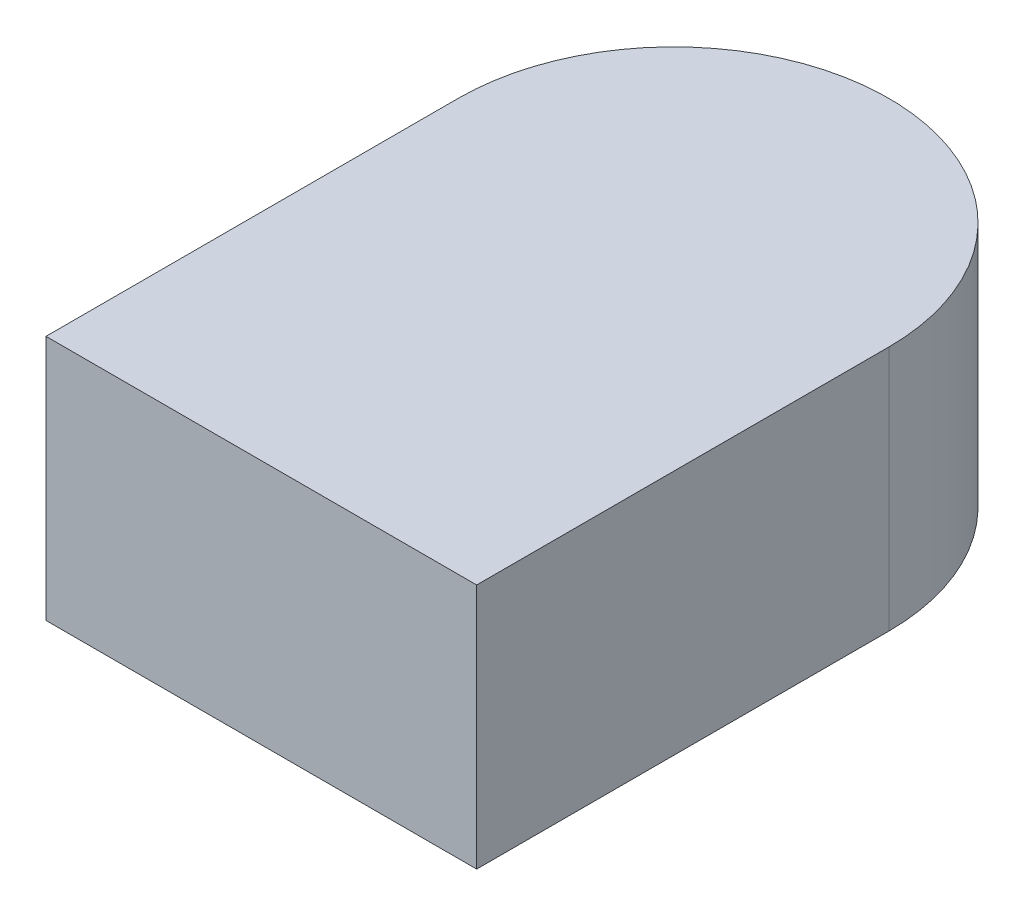
ISO-10303-21;
HEADER;
FILE_DESCRIPTION(('STEP AP214'),'2;1');
FILE_NAME('part.step','',(''),(''),'','','');
FILE_SCHEMA(('AUTOMOTIVE_DESIGN { 1 0 10303 214 1 1 1 1 }'));
ENDSEC;
DATA;
#1=APPLICATION_CONTEXT('core data for automotive mechanical design processes');
#2=APPLICATION_PROTOCOL_DEFINITION('international standard','automotive_design',2000,#1);
#3=PRODUCT_CONTEXT('',#1,'mechanical');
#4=PRODUCT('Part','Part','',(#3));
#5=PRODUCT_RELATED_PRODUCT_CATEGORY('part','',(#4));
#6=PRODUCT_DEFINITION_FORMATION('','',#4);
#7=PRODUCT_DEFINITION_CONTEXT('part definition',#1,'design');
#8=PRODUCT_DEFINITION('design','',#6,#7);
#9=PRODUCT_DEFINITION_SHAPE('','',#8);
#10=(LENGTH_UNIT() NAMED_UNIT(*) SI_UNIT(.MILLI.,.METRE.));
#11=(NAMED_UNIT(*) PLANE_ANGLE_UNIT() SI_UNIT($,.RADIAN.));
#12=(NAMED_UNIT(*) SI_UNIT($,.STERADIAN.) SOLID_ANGLE_UNIT());
#13=UNCERTAINTY_MEASURE_WITH_UNIT(LENGTH_MEASURE(1.E-05),#10,'distance_accuracy_value','');
#14=(GEOMETRIC_REPRESENTATION_CONTEXT(3) GLOBAL_UNCERTAINTY_ASSIGNED_CONTEXT((#13)) GLOBAL_UNIT_ASSIGNED_CONTEXT((#10,
#11,#12)) REPRESENTATION_CONTEXT('',''));
#15=CARTESIAN_POINT('',(0.,0.,0.));
#16=DIRECTION('',(0.,0.,1.));
#17=DIRECTION('',(1.,0.,0.));
#18=AXIS2_PLACEMENT_3D('',#15,#16,#17);
#19=CARTESIAN_POINT('',(0.175,0.2,-0.1675));
#20=DIRECTION('',(-1.,0.,0.));
#21=DIRECTION('',(0.,0.,1.));
#22=AXIS2_PLACEMENT_3D('',#19,#20,#21);
#23=PLANE('',#22);
#24=DIRECTION('',(0.,0.,-1.));
#25=VECTOR('',#24,1.);
#26=CARTESIAN_POINT('',(0.175,0.,-0.1675));
#27=LINE('',#26,#25);
#28=CARTESIAN_POINT('',(0.175,0.,0.1675));
#29=VERTEX_POINT('',#28);
#30=CARTESIAN_POINT('',(0.175,0.,-0.1675));
#31=VERTEX_POINT('',#30);
#32=EDGE_CURVE('E107',#29,#31,#27,.T.);
#33=ORIENTED_EDGE('',*,*,#32,.T.);
#34=DIRECTION('',(0.,-1.,0.));
#35=VECTOR('',#34,1.);
#36=CARTESIAN_POINT('',(0.175,0.2,-0.1675));
#37=LINE('',#36,#35);
#38=CARTESIAN_POINT('',(0.175,0.2,-0.1675));
#39=VERTEX_POINT('',#38);
#40=EDGE_CURVE('E11',#39,#31,#37,.T.);
#41=ORIENTED_EDGE('',*,*,#40,.F.);
#42=DIRECTION('',(0.,0.,-1.));
#43=VECTOR('',#42,1.);
#44=CARTESIAN_POINT('',(0.175,0.2,-0.1675));
#45=LINE('',#44,#43);
#46=CARTESIAN_POINT('',(0.175,0.2,0.1675));
#47=VERTEX_POINT('',#46);
#48=EDGE_CURVE('E91',#47,#39,#45,.T.);
#49=ORIENTED_EDGE('',*,*,#48,.F.);
#50=DIRECTION('',(0.,-1.,0.));
#51=VECTOR('',#50,1.);
#52=CARTESIAN_POINT('',(0.175,0.2,0.1675));
#53=LINE('',#52,#51);
#54=EDGE_CURVE('E103',#47,#29,#53,.T.);
#55=ORIENTED_EDGE('',*,*,#54,.T.);
#56=EDGE_LOOP('',(#33,#41,#49,#55));
#57=FACE_BOUND('',#56,.T.);
#58=ADVANCED_FACE('F39',(#57),#23,.F.);
#59=CARTESIAN_POINT('',(0.,0.2,-0.1675));
#60=DIRECTION('',(0.,-1.,0.));
#61=DIRECTION('',(0.,0.,-1.));
#62=AXIS2_PLACEMENT_3D('',#59,#60,#61);
#63=CYLINDRICAL_SURFACE('',#62,0.175);
#64=CARTESIAN_POINT('',(0.,0.,-0.1675));
#65=DIRECTION('',(0.,1.,0.));
#66=DIRECTION('',(0.,0.,1.));
#67=AXIS2_PLACEMENT_3D('',#64,#65,#66);
#68=CIRCLE('',#67,0.175);
#69=CARTESIAN_POINT('',(-0.175,0.,-0.1675));
#70=VERTEX_POINT('',#69);
#71=EDGE_CURVE('E96',#31,#70,#68,.T.);
#72=ORIENTED_EDGE('',*,*,#71,.T.);
#73=DIRECTION('',(0.,-1.,0.));
#74=VECTOR('',#73,1.);
#75=CARTESIAN_POINT('',(-0.175,0.2,-0.1675));
#76=LINE('',#75,#74);
#77=CARTESIAN_POINT('',(-0.175,0.2,-0.1675));
#78=VERTEX_POINT('',#77);
#79=EDGE_CURVE('E48',#78,#70,#76,.T.);
#80=ORIENTED_EDGE('',*,*,#79,.F.);
#81=CARTESIAN_POINT('',(0.,0.2,-0.1675));
#82=DIRECTION('',(0.,1.,0.));
#83=DIRECTION('',(0.,0.,1.));
#84=AXIS2_PLACEMENT_3D('',#81,#82,#83);
#85=CIRCLE('',#84,0.175);
#86=EDGE_CURVE('E86',#39,#78,#85,.T.);
#87=ORIENTED_EDGE('',*,*,#86,.F.);
#88=ORIENTED_EDGE('',*,*,#40,.T.);
#89=EDGE_LOOP('',(#72,#80,#87,#88));
#90=FACE_BOUND('',#89,.T.);
#91=ADVANCED_FACE('F95',(#90),#63,.T.);
#92=CARTESIAN_POINT('',(-0.175,0.2,-0.1675));
#93=DIRECTION('',(1.,0.,0.));
#94=DIRECTION('',(0.,0.,-1.));
#95=AXIS2_PLACEMENT_3D('',#92,#93,#94);
#96=PLANE('',#95);
#97=DIRECTION('',(0.,0.,1.));
#98=VECTOR('',#97,1.);
#99=CARTESIAN_POINT('',(-0.175,0.,-0.1675));
#100=LINE('',#99,#98);
#101=CARTESIAN_POINT('',(-0.175,0.,0.1675));
#102=VERTEX_POINT('',#101);
#103=EDGE_CURVE('E73',#70,#102,#100,.T.);
#104=ORIENTED_EDGE('',*,*,#103,.T.);
#105=DIRECTION('',(0.,-1.,0.));
#106=VECTOR('',#105,1.);
#107=CARTESIAN_POINT('',(-0.175,0.2,0.1675));
#108=LINE('',#107,#106);
#109=CARTESIAN_POINT('',(-0.175,0.2,0.1675));
#110=VERTEX_POINT('',#109);
#111=EDGE_CURVE('E98',#110,#102,#108,.T.);
#112=ORIENTED_EDGE('',*,*,#111,.F.);
#113=DIRECTION('',(0.,0.,1.));
#114=VECTOR('',#113,1.);
#115=CARTESIAN_POINT('',(-0.175,0.2,-0.1675));
#116=LINE('',#115,#114);
#117=EDGE_CURVE('E89',#78,#110,#116,.T.);
#118=ORIENTED_EDGE('',*,*,#117,.F.);
#119=ORIENTED_EDGE('',*,*,#79,.T.);
#120=EDGE_LOOP('',(#104,#112,#118,#119));
#121=FACE_BOUND('',#120,.T.);
#122=ADVANCED_FACE('F99',(#121),#96,.F.);
#123=CARTESIAN_POINT('',(-0.175,0.2,0.1675));
#124=DIRECTION('',(0.,0.,-1.));
#125=DIRECTION('',(-1.,0.,0.));
#126=AXIS2_PLACEMENT_3D('',#123,#124,#125);
#127=PLANE('',#126);
#128=DIRECTION('',(1.,0.,0.));
#129=VECTOR('',#128,1.);
#130=CARTESIAN_POINT('',(-0.175,0.,0.1675));
#131=LINE('',#130,#129);
#132=EDGE_CURVE('E79',#102,#29,#131,.T.);
#133=ORIENTED_EDGE('',*,*,#132,.T.);
#134=ORIENTED_EDGE('',*,*,#54,.F.);
#135=DIRECTION('',(1.,0.,0.));
#136=VECTOR('',#135,1.);
#137=CARTESIAN_POINT('',(-0.175,0.2,0.1675));
#138=LINE('',#137,#136);
#139=EDGE_CURVE('E56',#110,#47,#138,.T.);
#140=ORIENTED_EDGE('',*,*,#139,.F.);
#141=ORIENTED_EDGE('',*,*,#111,.T.);
#142=EDGE_LOOP('',(#133,#134,#140,#141));
#143=FACE_BOUND('',#142,.T.);
#144=ADVANCED_FACE('F120',(#143),#127,.F.);
#145=CARTESIAN_POINT('',(0.,0.2,-0.1675));
#146=DIRECTION('',(0.,1.,0.));
#147=DIRECTION('',(0.,0.,1.));
#148=AXIS2_PLACEMENT_3D('',#145,#146,#147);
#149=PLANE('',#148);
#150=ORIENTED_EDGE('',*,*,#48,.T.);
#151=ORIENTED_EDGE('',*,*,#86,.T.);
#152=ORIENTED_EDGE('',*,*,#117,.T.);
#153=ORIENTED_EDGE('',*,*,#139,.T.);
#154=EDGE_LOOP('',(#150,#151,#152,#153));
#155=FACE_BOUND('',#154,.T.);
#156=ADVANCED_FACE('F87',(#155),#149,.T.);
#157=CARTESIAN_POINT('',(0.,0.,-0.1675));
#158=DIRECTION('',(0.,1.,0.));
#159=DIRECTION('',(0.,0.,1.));
#160=AXIS2_PLACEMENT_3D('',#157,#158,#159);
#161=PLANE('',#160);
#162=ORIENTED_EDGE('',*,*,#32,.F.);
#163=ORIENTED_EDGE('',*,*,#132,.F.);
#164=ORIENTED_EDGE('',*,*,#103,.F.);
#165=ORIENTED_EDGE('',*,*,#71,.F.);
#166=EDGE_LOOP('',(#162,#163,#164,#165));
#167=FACE_BOUND('',#166,.T.);
#168=ADVANCED_FACE('F123',(#167),#161,.F.);
#169=CLOSED_SHELL('',(#58,#91,#122,#144,#156,#168));
#170=MANIFOLD_SOLID_BREP('B2',#169);
#171=ADVANCED_BREP_SHAPE_REPRESENTATION('',(#18,#170),#14);
#172=SHAPE_DEFINITION_REPRESENTATION(#9,#171);
ENDSEC;
END-ISO-10303-21;
